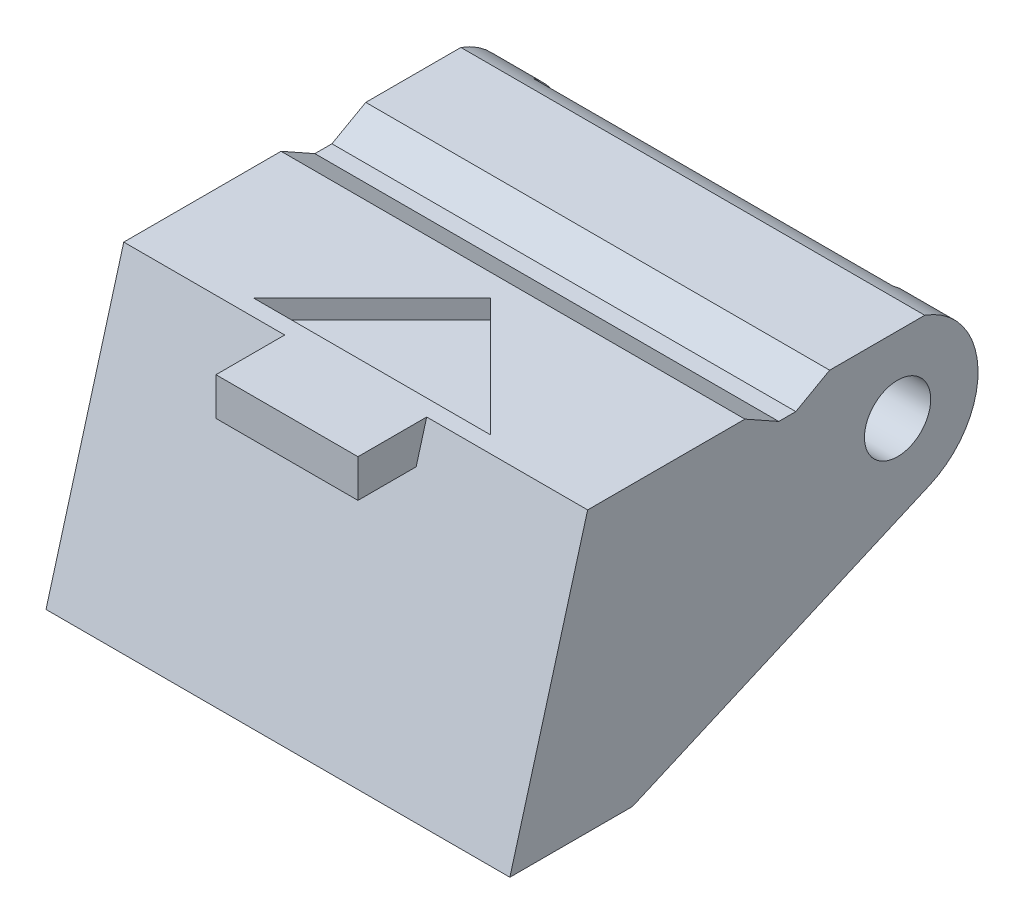
ISO-10303-21;
HEADER;
FILE_DESCRIPTION(('STEP AP214'),'2;1');
FILE_NAME('part.step','',(''),(''),'','','');
FILE_SCHEMA(('AUTOMOTIVE_DESIGN { 1 0 10303 214 1 1 1 1 }'));
ENDSEC;
DATA;
#1=APPLICATION_CONTEXT('core data for automotive mechanical design processes');
#2=APPLICATION_PROTOCOL_DEFINITION('international standard','automotive_design',2000,#1);
#3=PRODUCT_CONTEXT('',#1,'mechanical');
#4=PRODUCT('Part','Part','',(#3));
#5=PRODUCT_RELATED_PRODUCT_CATEGORY('part','',(#4));
#6=PRODUCT_DEFINITION_FORMATION('','',#4);
#7=PRODUCT_DEFINITION_CONTEXT('part definition',#1,'design');
#8=PRODUCT_DEFINITION('design','',#6,#7);
#9=PRODUCT_DEFINITION_SHAPE('','',#8);
#10=(LENGTH_UNIT() NAMED_UNIT(*) SI_UNIT(.MILLI.,.METRE.));
#11=(NAMED_UNIT(*) PLANE_ANGLE_UNIT() SI_UNIT($,.RADIAN.));
#12=(NAMED_UNIT(*) SI_UNIT($,.STERADIAN.) SOLID_ANGLE_UNIT());
#13=UNCERTAINTY_MEASURE_WITH_UNIT(LENGTH_MEASURE(1.E-05),#10,'distance_accuracy_value','');
#14=(GEOMETRIC_REPRESENTATION_CONTEXT(3) GLOBAL_UNCERTAINTY_ASSIGNED_CONTEXT((#13)) GLOBAL_UNIT_ASSIGNED_CONTEXT((#10,
#11,#12)) REPRESENTATION_CONTEXT('',''));
#15=CARTESIAN_POINT('',(0.,0.,0.));
#16=DIRECTION('',(0.,0.,1.));
#17=DIRECTION('',(1.,0.,0.));
#18=AXIS2_PLACEMENT_3D('',#15,#16,#17);
#19=CARTESIAN_POINT('',(4.9,1.6,-1.7));
#20=DIRECTION('',(0.,-1.,0.));
#21=DIRECTION('',(0.,0.,-1.));
#22=AXIS2_PLACEMENT_3D('',#19,#20,#21);
#23=PLANE('',#22);
#24=DIRECTION('',(0.,0.,1.));
#25=VECTOR('',#24,1.);
#26=CARTESIAN_POINT('',(-4.9,1.6,-1.7));
#27=LINE('',#26,#25);
#28=CARTESIAN_POINT('',(-4.9,1.6,-0.574456264653803));
#29=VERTEX_POINT('',#28);
#30=CARTESIAN_POINT('',(-4.9,1.6,1.435));
#31=VERTEX_POINT('',#30);
#32=EDGE_CURVE('E189',#29,#31,#27,.T.);
#33=ORIENTED_EDGE('',*,*,#32,.T.);
#34=DIRECTION('',(1.,0.,0.));
#35=VECTOR('',#34,1.);
#36=CARTESIAN_POINT('',(-5.,1.6,1.435));
#37=LINE('',#36,#35);
#38=CARTESIAN_POINT('',(4.9,1.6,1.435));
#39=VERTEX_POINT('',#38);
#40=EDGE_CURVE('E294',#31,#39,#37,.T.);
#41=ORIENTED_EDGE('',*,*,#40,.T.);
#42=DIRECTION('',(0.,0.,1.));
#43=VECTOR('',#42,1.);
#44=CARTESIAN_POINT('',(4.9,1.6,-1.7));
#45=LINE('',#44,#43);
#46=CARTESIAN_POINT('',(4.9,1.6,-0.574456264653803));
#47=VERTEX_POINT('',#46);
#48=EDGE_CURVE('E279',#47,#39,#45,.T.);
#49=ORIENTED_EDGE('',*,*,#48,.F.);
#50=DIRECTION('',(-1.,0.,0.));
#51=VECTOR('',#50,1.);
#52=CARTESIAN_POINT('',(4.9,1.6,-0.574456264653803));
#53=LINE('',#52,#51);
#54=EDGE_CURVE('E266',#47,#29,#53,.T.);
#55=ORIENTED_EDGE('',*,*,#54,.T.);
#56=EDGE_LOOP('',(#33,#41,#49,#55));
#57=FACE_BOUND('',#56,.T.);
#58=ADVANCED_FACE('F17',(#57),#23,.F.);
#59=CARTESIAN_POINT('',(4.9,0.,0.));
#60=DIRECTION('',(-1.,0.,0.));
#61=DIRECTION('',(0.,0.,1.));
#62=AXIS2_PLACEMENT_3D('',#59,#60,#61);
#63=CYLINDRICAL_SURFACE('',#62,1.7);
#64=CARTESIAN_POINT('',(3.8,0.,0.));
#65=DIRECTION('',(1.,0.,0.));
#66=DIRECTION('',(0.,0.,-1.));
#67=AXIS2_PLACEMENT_3D('',#64,#65,#66);
#68=CIRCLE('',#67,1.7);
#69=CARTESIAN_POINT('',(3.8,-1.55797498876303,-0.680230794943039));
#70=VERTEX_POINT('',#69);
#71=CARTESIAN_POINT('',(3.8,1.38081445189058,-0.991640786499881));
#72=VERTEX_POINT('',#71);
#73=EDGE_CURVE('E256',#70,#72,#68,.T.);
#74=ORIENTED_EDGE('',*,*,#73,.T.);
#75=DIRECTION('',(-1.,0.,0.));
#76=VECTOR('',#75,1.);
#77=CARTESIAN_POINT('',(3.8,1.38081445189058,-0.991640786499881));
#78=LINE('',#77,#76);
#79=CARTESIAN_POINT('',(-3.8,1.38081445189058,-0.991640786499881));
#80=VERTEX_POINT('',#79);
#81=EDGE_CURVE('E233',#72,#80,#78,.T.);
#82=ORIENTED_EDGE('',*,*,#81,.T.);
#83=CARTESIAN_POINT('',(-3.8,0.,0.));
#84=DIRECTION('',(1.,0.,0.));
#85=DIRECTION('',(0.,0.,-1.));
#86=AXIS2_PLACEMENT_3D('',#83,#84,#85);
#87=CIRCLE('',#86,1.7);
#88=CARTESIAN_POINT('',(-3.8,-1.55797498876303,-0.680230794943039));
#89=VERTEX_POINT('',#88);
#90=EDGE_CURVE('E339',#89,#80,#87,.T.);
#91=ORIENTED_EDGE('',*,*,#90,.F.);
#92=DIRECTION('',(1.,0.,0.));
#93=VECTOR('',#92,1.);
#94=CARTESIAN_POINT('',(-4.9,-1.55797498876303,-0.680230794943039));
#95=LINE('',#94,#93);
#96=CARTESIAN_POINT('',(-4.9,-1.55797498876303,-0.680230794943039));
#97=VERTEX_POINT('',#96);
#98=EDGE_CURVE('E190',#97,#89,#95,.T.);
#99=ORIENTED_EDGE('',*,*,#98,.F.);
#100=CARTESIAN_POINT('',(-4.9,0.,0.));
#101=DIRECTION('',(-1.,0.,0.));
#102=DIRECTION('',(0.,0.,-1.));
#103=AXIS2_PLACEMENT_3D('',#100,#101,#102);
#104=CIRCLE('',#103,1.7);
#105=EDGE_CURVE('E348',#29,#97,#104,.T.);
#106=ORIENTED_EDGE('',*,*,#105,.F.);
#107=ORIENTED_EDGE('',*,*,#54,.F.);
#108=CARTESIAN_POINT('',(4.9,0.,0.));
#109=DIRECTION('',(-1.,0.,0.));
#110=DIRECTION('',(0.,0.,-1.));
#111=AXIS2_PLACEMENT_3D('',#108,#109,#110);
#112=CIRCLE('',#111,1.7);
#113=CARTESIAN_POINT('',(4.9,-1.55797498876303,-0.680230794943039));
#114=VERTEX_POINT('',#113);
#115=EDGE_CURVE('E268',#47,#114,#112,.T.);
#116=ORIENTED_EDGE('',*,*,#115,.T.);
#117=DIRECTION('',(-1.,0.,0.));
#118=VECTOR('',#117,1.);
#119=CARTESIAN_POINT('',(4.9,-1.55797498876303,-0.680230794943039));
#120=LINE('',#119,#118);
#121=EDGE_CURVE('E276',#114,#70,#120,.T.);
#122=ORIENTED_EDGE('',*,*,#121,.T.);
#123=EDGE_LOOP('',(#74,#82,#91,#99,#106,#107,#116,#122));
#124=FACE_BOUND('',#123,.T.);
#125=ADVANCED_FACE('F388',(#124),#63,.T.);
#126=CARTESIAN_POINT('',(3.8,0.799999999999999,5.94));
#127=DIRECTION('',(0.,-1.,0.));
#128=DIRECTION('',(0.,0.,-1.));
#129=AXIS2_PLACEMENT_3D('',#126,#127,#128);
#130=PLANE('',#129);
#131=DIRECTION('',(-1.,0.,0.));
#132=VECTOR('',#131,1.);
#133=CARTESIAN_POINT('',(3.8,0.799999999999999,5.94));
#134=LINE('',#133,#132);
#135=CARTESIAN_POINT('',(3.8,0.799999999999999,5.94));
#136=VERTEX_POINT('',#135);
#137=CARTESIAN_POINT('',(-3.8,0.799999999999999,5.94));
#138=VERTEX_POINT('',#137);
#139=EDGE_CURVE('E264',#136,#138,#134,.T.);
#140=ORIENTED_EDGE('',*,*,#139,.T.);
#141=DIRECTION('',(0.,0.,1.));
#142=VECTOR('',#141,1.);
#143=CARTESIAN_POINT('',(-3.8,0.799999999999999,5.94));
#144=LINE('',#143,#142);
#145=CARTESIAN_POINT('',(-3.8,0.799999999999999,0.0143593539448927));
#146=VERTEX_POINT('',#145);
#147=EDGE_CURVE('E342',#146,#138,#144,.T.);
#148=ORIENTED_EDGE('',*,*,#147,.F.);
#149=DIRECTION('',(-1.,0.,0.));
#150=VECTOR('',#149,1.);
#151=CARTESIAN_POINT('',(3.8,0.799999999999999,0.0143593539448927));
#152=LINE('',#151,#150);
#153=CARTESIAN_POINT('',(3.8,0.799999999999999,0.0143593539448927));
#154=VERTEX_POINT('',#153);
#155=EDGE_CURVE('E231',#154,#146,#152,.T.);
#156=ORIENTED_EDGE('',*,*,#155,.F.);
#157=DIRECTION('',(0.,0.,1.));
#158=VECTOR('',#157,1.);
#159=CARTESIAN_POINT('',(3.8,0.799999999999999,5.94));
#160=LINE('',#159,#158);
#161=EDGE_CURVE('E258',#154,#136,#160,.T.);
#162=ORIENTED_EDGE('',*,*,#161,.T.);
#163=EDGE_LOOP('',(#140,#148,#156,#162));
#164=FACE_BOUND('',#163,.T.);
#165=ADVANCED_FACE('F394',(#164),#130,.T.);
#166=CARTESIAN_POINT('',(4.9,1.6,-1.7));
#167=DIRECTION('',(-1.,0.,0.));
#168=DIRECTION('',(0.,0.,1.));
#169=AXIS2_PLACEMENT_3D('',#166,#167,#168);
#170=PLANE('',#169);
#171=ORIENTED_EDGE('',*,*,#48,.T.);
#172=DIRECTION('',(0.,-0.488231650079598,0.872714074517281));
#173=VECTOR('',#172,1.);
#174=CARTESIAN_POINT('',(4.9,2.93578159335544,-0.952709598122836));
#175=LINE('',#174,#173);
#176=CARTESIAN_POINT('',(4.9,1.2,2.15));
#177=VERTEX_POINT('',#176);
#178=EDGE_CURVE('E303',#39,#177,#175,.T.);
#179=ORIENTED_EDGE('',*,*,#178,.T.);
#180=DIRECTION('',(0.,0.,1.));
#181=VECTOR('',#180,1.);
#182=CARTESIAN_POINT('',(4.9,1.2,-1.7));
#183=LINE('',#182,#181);
#184=CARTESIAN_POINT('',(4.9,1.2,2.51));
#185=VERTEX_POINT('',#184);
#186=EDGE_CURVE('E291',#177,#185,#183,.T.);
#187=ORIENTED_EDGE('',*,*,#186,.T.);
#188=DIRECTION('',(0.,0.488231650079598,0.872714074517281));
#189=VECTOR('',#188,1.);
#190=CARTESIAN_POINT('',(4.9,-0.498476665797609,-0.526027040113224));
#191=LINE('',#190,#189);
#192=CARTESIAN_POINT('',(4.9,1.6,3.225));
#193=VERTEX_POINT('',#192);
#194=EDGE_CURVE('E297',#185,#193,#191,.T.);
#195=ORIENTED_EDGE('',*,*,#194,.T.);
#196=CARTESIAN_POINT('',(4.9,1.6,6.54768574116445));
#197=VERTEX_POINT('',#196);
#198=EDGE_CURVE('E181',#193,#197,#45,.T.);
#199=ORIENTED_EDGE('',*,*,#198,.T.);
#200=DIRECTION('',(0.,0.963355359932388,-0.268228355118429));
#201=VECTOR('',#200,1.);
#202=CARTESIAN_POINT('',(4.9,0.799999999999999,6.77043083920366));
#203=LINE('',#202,#201);
#204=CARTESIAN_POINT('',(4.9,-4.3,8.19043083920366));
#205=VERTEX_POINT('',#204);
#206=EDGE_CURVE('E243',#205,#197,#203,.T.);
#207=ORIENTED_EDGE('',*,*,#206,.F.);
#208=DIRECTION('',(0.,0.,-1.));
#209=VECTOR('',#208,1.);
#210=CARTESIAN_POINT('',(4.9,-4.3,-1.7));
#211=LINE('',#210,#209);
#212=CARTESIAN_POINT('',(4.9,-4.3,5.6));
#213=VERTEX_POINT('',#212);
#214=EDGE_CURVE('E173',#205,#213,#211,.T.);
#215=ORIENTED_EDGE('',*,*,#214,.T.);
#216=DIRECTION('',(0.,-0.4001357617312,0.916455875742958));
#217=VECTOR('',#216,1.);
#218=CARTESIAN_POINT('',(4.9,-4.3,5.6));
#219=LINE('',#218,#217);
#220=EDGE_CURVE('E270',#114,#213,#219,.T.);
#221=ORIENTED_EDGE('',*,*,#220,.F.);
#222=ORIENTED_EDGE('',*,*,#115,.F.);
#223=EDGE_LOOP('',(#171,#179,#187,#195,#199,#207,#215,#221,#222));
#224=FACE_BOUND('',#223,.T.);
#225=CARTESIAN_POINT('',(4.9,0.,0.));
#226=DIRECTION('',(1.,0.,0.));
#227=DIRECTION('',(0.,0.,-1.));
#228=AXIS2_PLACEMENT_3D('',#225,#226,#227);
#229=CIRCLE('',#228,0.7);
#230=CARTESIAN_POINT('',(4.9,0.,-0.7));
#231=VERTEX_POINT('',#230);
#232=EDGE_CURVE('E235',#231,#231,#229,.T.);
#233=ORIENTED_EDGE('',*,*,#232,.F.);
#234=EDGE_LOOP('',(#233));
#235=FACE_BOUND('',#234,.T.);
#236=ADVANCED_FACE('F380',(#224,#235),#170,.F.);
#237=CARTESIAN_POINT('',(3.8,0.,0.));
#238=DIRECTION('',(1.,0.,0.));
#239=DIRECTION('',(0.,0.,-1.));
#240=AXIS2_PLACEMENT_3D('',#237,#238,#239);
#241=PLANE('',#240);
#242=DIRECTION('',(0.,0.,-1.));
#243=VECTOR('',#242,1.);
#244=CARTESIAN_POINT('',(3.8,-4.3,7.36));
#245=LINE('',#244,#243);
#246=CARTESIAN_POINT('',(3.8,-4.3,7.36));
#247=VERTEX_POINT('',#246);
#248=CARTESIAN_POINT('',(3.8,-4.3,5.6));
#249=VERTEX_POINT('',#248);
#250=EDGE_CURVE('E250',#247,#249,#245,.T.);
#251=ORIENTED_EDGE('',*,*,#250,.F.);
#252=DIRECTION('',(0.,-0.963355359932388,0.268228355118429));
#253=VECTOR('',#252,1.);
#254=CARTESIAN_POINT('',(3.8,-4.3,7.36));
#255=LINE('',#254,#253);
#256=EDGE_CURVE('E260',#136,#247,#255,.T.);
#257=ORIENTED_EDGE('',*,*,#256,.F.);
#258=ORIENTED_EDGE('',*,*,#161,.F.);
#259=DIRECTION('',(0.,-0.499999999999995,0.866025403784441));
#260=VECTOR('',#259,1.);
#261=CARTESIAN_POINT('',(3.8,0.799999999999999,0.0143593539448927));
#262=LINE('',#261,#260);
#263=EDGE_CURVE('E229',#72,#154,#262,.T.);
#264=ORIENTED_EDGE('',*,*,#263,.F.);
#265=ORIENTED_EDGE('',*,*,#73,.F.);
#266=DIRECTION('',(0.,0.4001357617312,-0.916455875742958));
#267=VECTOR('',#266,1.);
#268=CARTESIAN_POINT('',(3.8,-1.55797498876303,-0.680230794943039));
#269=LINE('',#268,#267);
#270=EDGE_CURVE('E253',#249,#70,#269,.T.);
#271=ORIENTED_EDGE('',*,*,#270,.F.);
#272=EDGE_LOOP('',(#251,#257,#258,#264,#265,#271));
#273=FACE_BOUND('',#272,.T.);
#274=CARTESIAN_POINT('',(3.8,0.,0.));
#275=DIRECTION('',(1.,0.,0.));
#276=DIRECTION('',(0.,0.,-1.));
#277=AXIS2_PLACEMENT_3D('',#274,#275,#276);
#278=CIRCLE('',#277,0.7);
#279=CARTESIAN_POINT('',(3.8,0.,-0.7));
#280=VERTEX_POINT('',#279);
#281=EDGE_CURVE('E238',#280,#280,#278,.F.);
#282=ORIENTED_EDGE('',*,*,#281,.F.);
#283=EDGE_LOOP('',(#282));
#284=FACE_BOUND('',#283,.T.);
#285=ADVANCED_FACE('F397',(#273,#284),#241,.F.);
#286=DIRECTION('',(0.707106781186548,0.,-0.707106781186548));
#287=VECTOR('',#286,1.);
#288=CARTESIAN_POINT('',(0.,1.6,3.7));
#289=LINE('',#288,#287);
#290=CARTESIAN_POINT('',(-2.5,1.6,6.2));
#291=VERTEX_POINT('',#290);
#292=CARTESIAN_POINT('',(0.,1.6,3.7));
#293=VERTEX_POINT('',#292);
#294=EDGE_CURVE('E305',#291,#293,#289,.T.);
#295=ORIENTED_EDGE('',*,*,#294,.T.);
#296=DIRECTION('',(-0.707106781186548,0.,-0.707106781186548));
#297=VECTOR('',#296,1.);
#298=CARTESIAN_POINT('',(0.,1.6,3.7));
#299=LINE('',#298,#297);
#300=CARTESIAN_POINT('',(2.5,1.6,6.2));
#301=VERTEX_POINT('',#300);
#302=EDGE_CURVE('E201',#301,#293,#299,.T.);
#303=ORIENTED_EDGE('',*,*,#302,.F.);
#304=DIRECTION('',(1.,0.,0.));
#305=VECTOR('',#304,1.);
#306=CARTESIAN_POINT('',(2.5,1.6,6.2));
#307=LINE('',#306,#305);
#308=EDGE_CURVE('E208',#291,#301,#307,.T.);
#309=ORIENTED_EDGE('',*,*,#308,.F.);
#310=EDGE_LOOP('',(#295,#303,#309));
#311=FACE_BOUND('',#310,.T.);
#312=ORIENTED_EDGE('',*,*,#198,.F.);
#313=DIRECTION('',(1.,0.,0.));
#314=VECTOR('',#313,1.);
#315=CARTESIAN_POINT('',(-5.,1.6,3.225));
#316=LINE('',#315,#314);
#317=CARTESIAN_POINT('',(-4.9,1.6,3.225));
#318=VERTEX_POINT('',#317);
#319=EDGE_CURVE('E168',#318,#193,#316,.T.);
#320=ORIENTED_EDGE('',*,*,#319,.F.);
#321=CARTESIAN_POINT('',(-4.9,1.6,6.54768574116444));
#322=VERTEX_POINT('',#321);
#323=EDGE_CURVE('E178',#318,#322,#27,.T.);
#324=ORIENTED_EDGE('',*,*,#323,.T.);
#325=DIRECTION('',(-1.,0.,0.));
#326=VECTOR('',#325,1.);
#327=CARTESIAN_POINT('',(-1.5,1.6,6.54768574116445));
#328=LINE('',#327,#326);
#329=CARTESIAN_POINT('',(-1.5,1.6,6.54768574116445));
#330=VERTEX_POINT('',#329);
#331=EDGE_CURVE('E326',#330,#322,#328,.T.);
#332=ORIENTED_EDGE('',*,*,#331,.F.);
#333=DIRECTION('',(0.,0.,1.));
#334=VECTOR('',#333,1.);
#335=CARTESIAN_POINT('',(-1.5,1.6,6.54768574116445));
#336=LINE('',#335,#334);
#337=CARTESIAN_POINT('',(-1.5,1.6,8.));
#338=VERTEX_POINT('',#337);
#339=EDGE_CURVE('E320',#330,#338,#336,.T.);
#340=ORIENTED_EDGE('',*,*,#339,.T.);
#341=DIRECTION('',(-1.,0.,0.));
#342=VECTOR('',#341,1.);
#343=CARTESIAN_POINT('',(4.9,1.6,8.));
#344=LINE('',#343,#342);
#345=CARTESIAN_POINT('',(1.5,1.6,8.));
#346=VERTEX_POINT('',#345);
#347=EDGE_CURVE('E239',#346,#338,#344,.T.);
#348=ORIENTED_EDGE('',*,*,#347,.F.);
#349=DIRECTION('',(0.,0.,1.));
#350=VECTOR('',#349,1.);
#351=CARTESIAN_POINT('',(1.5,1.6,6.54768574116445));
#352=LINE('',#351,#350);
#353=CARTESIAN_POINT('',(1.5,1.6,6.54768574116445));
#354=VERTEX_POINT('',#353);
#355=EDGE_CURVE('E40',#354,#346,#352,.T.);
#356=ORIENTED_EDGE('',*,*,#355,.F.);
#357=DIRECTION('',(1.,0.,0.));
#358=VECTOR('',#357,1.);
#359=CARTESIAN_POINT('',(1.5,1.6,6.54768574116445));
#360=LINE('',#359,#358);
#361=EDGE_CURVE('E227',#354,#197,#360,.T.);
#362=ORIENTED_EDGE('',*,*,#361,.T.);
#363=EDGE_LOOP('',(#312,#320,#324,#332,#340,#348,#356,#362));
#364=FACE_BOUND('',#363,.T.);
#365=ADVANCED_FACE('F19',(#311,#364),#23,.F.);
#366=CARTESIAN_POINT('',(4.9,0.799999999999999,6.77043083920366));
#367=DIRECTION('',(0.,-1.,0.));
#368=DIRECTION('',(0.,0.,-1.));
#369=AXIS2_PLACEMENT_3D('',#366,#367,#368);
#370=PLANE('',#369);
#371=DIRECTION('',(0.,0.,-1.));
#372=VECTOR('',#371,1.);
#373=CARTESIAN_POINT('',(1.5,0.799999999999999,6.77043083920366));
#374=LINE('',#373,#372);
#375=CARTESIAN_POINT('',(1.5,0.799999999999999,8.));
#376=VERTEX_POINT('',#375);
#377=CARTESIAN_POINT('',(1.5,0.799999999999999,6.77043083920366));
#378=VERTEX_POINT('',#377);
#379=EDGE_CURVE('E219',#376,#378,#374,.T.);
#380=ORIENTED_EDGE('',*,*,#379,.F.);
#381=DIRECTION('',(-1.,0.,0.));
#382=VECTOR('',#381,1.);
#383=CARTESIAN_POINT('',(4.9,0.799999999999999,8.));
#384=LINE('',#383,#382);
#385=CARTESIAN_POINT('',(-1.5,0.799999999999999,8.));
#386=VERTEX_POINT('',#385);
#387=EDGE_CURVE('E241',#376,#386,#384,.T.);
#388=ORIENTED_EDGE('',*,*,#387,.T.);
#389=DIRECTION('',(0.,0.,-1.));
#390=VECTOR('',#389,1.);
#391=CARTESIAN_POINT('',(-1.5,0.799999999999999,6.77043083920366));
#392=LINE('',#391,#390);
#393=CARTESIAN_POINT('',(-1.5,0.799999999999999,6.77043083920366));
#394=VERTEX_POINT('',#393);
#395=EDGE_CURVE('E313',#386,#394,#392,.T.);
#396=ORIENTED_EDGE('',*,*,#395,.T.);
#397=DIRECTION('',(-1.,0.,0.));
#398=VECTOR('',#397,1.);
#399=CARTESIAN_POINT('',(4.9,0.799999999999999,6.77043083920366));
#400=LINE('',#399,#398);
#401=EDGE_CURVE('E246',#378,#394,#400,.T.);
#402=ORIENTED_EDGE('',*,*,#401,.F.);
#403=EDGE_LOOP('',(#380,#388,#396,#402));
#404=FACE_BOUND('',#403,.T.);
#405=ADVANCED_FACE('F421',(#404),#370,.T.);
#406=CARTESIAN_POINT('',(4.9,-4.3,-1.7));
#407=DIRECTION('',(0.,1.,0.));
#408=DIRECTION('',(0.,0.,1.));
#409=AXIS2_PLACEMENT_3D('',#406,#407,#408);
#410=PLANE('',#409);
#411=DIRECTION('',(-1.,0.,0.));
#412=VECTOR('',#411,1.);
#413=CARTESIAN_POINT('',(4.9,-4.3,8.19043083920366));
#414=LINE('',#413,#412);
#415=CARTESIAN_POINT('',(-4.9,-4.3,8.19043083920366));
#416=VERTEX_POINT('',#415);
#417=EDGE_CURVE('E248',#205,#416,#414,.T.);
#418=ORIENTED_EDGE('',*,*,#417,.T.);
#419=DIRECTION('',(0.,0.,-1.));
#420=VECTOR('',#419,1.);
#421=CARTESIAN_POINT('',(-4.9,-4.3,-1.7));
#422=LINE('',#421,#420);
#423=CARTESIAN_POINT('',(-4.9,-4.3,5.6));
#424=VERTEX_POINT('',#423);
#425=EDGE_CURVE('E193',#416,#424,#422,.T.);
#426=ORIENTED_EDGE('',*,*,#425,.T.);
#427=DIRECTION('',(1.,0.,0.));
#428=VECTOR('',#427,1.);
#429=CARTESIAN_POINT('',(-4.9,-4.3,5.6));
#430=LINE('',#429,#428);
#431=CARTESIAN_POINT('',(-3.8,-4.3,5.6));
#432=VERTEX_POINT('',#431);
#433=EDGE_CURVE('E195',#424,#432,#430,.T.);
#434=ORIENTED_EDGE('',*,*,#433,.T.);
#435=DIRECTION('',(0.,0.,-1.));
#436=VECTOR('',#435,1.);
#437=CARTESIAN_POINT('',(-3.8,-4.3,7.36));
#438=LINE('',#437,#436);
#439=CARTESIAN_POINT('',(-3.8,-4.3,7.36));
#440=VERTEX_POINT('',#439);
#441=EDGE_CURVE('E334',#440,#432,#438,.T.);
#442=ORIENTED_EDGE('',*,*,#441,.F.);
#443=DIRECTION('',(-1.,0.,0.));
#444=VECTOR('',#443,1.);
#445=CARTESIAN_POINT('',(3.8,-4.3,7.36));
#446=LINE('',#445,#444);
#447=EDGE_CURVE('E262',#247,#440,#446,.T.);
#448=ORIENTED_EDGE('',*,*,#447,.F.);
#449=ORIENTED_EDGE('',*,*,#250,.T.);
#450=DIRECTION('',(-1.,0.,0.));
#451=VECTOR('',#450,1.);
#452=CARTESIAN_POINT('',(4.9,-4.3,5.6));
#453=LINE('',#452,#451);
#454=EDGE_CURVE('E273',#213,#249,#453,.T.);
#455=ORIENTED_EDGE('',*,*,#454,.F.);
#456=ORIENTED_EDGE('',*,*,#214,.F.);
#457=EDGE_LOOP('',(#418,#426,#434,#442,#448,#449,#455,#456));
#458=FACE_BOUND('',#457,.T.);
#459=ADVANCED_FACE('F356',(#458),#410,.F.);
#460=CARTESIAN_POINT('',(4.9,-4.3,5.6));
#461=DIRECTION('',(0.,-0.916455875742958,-0.4001357617312));
#462=DIRECTION('',(0.,0.4001357617312,-0.916455875742958));
#463=AXIS2_PLACEMENT_3D('',#460,#461,#462);
#464=PLANE('',#463);
#465=ORIENTED_EDGE('',*,*,#270,.T.);
#466=ORIENTED_EDGE('',*,*,#121,.F.);
#467=ORIENTED_EDGE('',*,*,#220,.T.);
#468=ORIENTED_EDGE('',*,*,#454,.T.);
#469=EDGE_LOOP('',(#465,#466,#467,#468));
#470=FACE_BOUND('',#469,.T.);
#471=ADVANCED_FACE('F376',(#470),#464,.T.);
#472=CARTESIAN_POINT('',(3.8,-4.3,7.36));
#473=DIRECTION('',(0.,-0.268228355118429,-0.963355359932388));
#474=DIRECTION('',(0.,0.963355359932389,-0.268228355118429));
#475=AXIS2_PLACEMENT_3D('',#472,#473,#474);
#476=PLANE('',#475);
#477=ORIENTED_EDGE('',*,*,#447,.T.);
#478=DIRECTION('',(0.,-0.963355359932388,0.268228355118429));
#479=VECTOR('',#478,1.);
#480=CARTESIAN_POINT('',(-3.8,-4.3,7.36));
#481=LINE('',#480,#479);
#482=EDGE_CURVE('E345',#138,#440,#481,.T.);
#483=ORIENTED_EDGE('',*,*,#482,.F.);
#484=ORIENTED_EDGE('',*,*,#139,.F.);
#485=ORIENTED_EDGE('',*,*,#256,.T.);
#486=EDGE_LOOP('',(#477,#483,#484,#485));
#487=FACE_BOUND('',#486,.T.);
#488=ADVANCED_FACE('F369',(#487),#476,.T.);
#489=CARTESIAN_POINT('',(4.9,0.799999999999999,6.77043083920366));
#490=DIRECTION('',(0.,0.268228355118429,0.963355359932388));
#491=DIRECTION('',(0.,-0.963355359932389,0.268228355118429));
#492=AXIS2_PLACEMENT_3D('',#489,#490,#491);
#493=PLANE('',#492);
#494=ORIENTED_EDGE('',*,*,#401,.T.);
#495=DIRECTION('',(0.,0.963355359932388,-0.268228355118431));
#496=VECTOR('',#495,1.);
#497=CARTESIAN_POINT('',(-1.5,1.6,6.54768574116445));
#498=LINE('',#497,#496);
#499=EDGE_CURVE('E318',#394,#330,#498,.T.);
#500=ORIENTED_EDGE('',*,*,#499,.T.);
#501=ORIENTED_EDGE('',*,*,#331,.T.);
#502=DIRECTION('',(0.,0.963355359932388,-0.268228355118429));
#503=VECTOR('',#502,1.);
#504=CARTESIAN_POINT('',(-4.9,0.799999999999999,6.77043083920366));
#505=LINE('',#504,#503);
#506=EDGE_CURVE('E188',#416,#322,#505,.T.);
#507=ORIENTED_EDGE('',*,*,#506,.F.);
#508=ORIENTED_EDGE('',*,*,#417,.F.);
#509=ORIENTED_EDGE('',*,*,#206,.T.);
#510=ORIENTED_EDGE('',*,*,#361,.F.);
#511=DIRECTION('',(0.,0.963355359932388,-0.268228355118431));
#512=VECTOR('',#511,1.);
#513=CARTESIAN_POINT('',(1.5,1.6,6.54768574116445));
#514=LINE('',#513,#512);
#515=EDGE_CURVE('E222',#378,#354,#514,.T.);
#516=ORIENTED_EDGE('',*,*,#515,.F.);
#517=EDGE_LOOP('',(#494,#500,#501,#507,#508,#509,#510,#516));
#518=FACE_BOUND('',#517,.T.);
#519=ADVANCED_FACE('F385',(#518),#493,.T.);
#520=CARTESIAN_POINT('',(4.9,1.6,8.));
#521=DIRECTION('',(0.,0.,1.));
#522=DIRECTION('',(1.,0.,0.));
#523=AXIS2_PLACEMENT_3D('',#520,#521,#522);
#524=PLANE('',#523);
#525=DIRECTION('',(0.,-1.,0.));
#526=VECTOR('',#525,1.);
#527=CARTESIAN_POINT('',(1.5,0.799999999999999,8.));
#528=LINE('',#527,#526);
#529=EDGE_CURVE('E225',#346,#376,#528,.T.);
#530=ORIENTED_EDGE('',*,*,#529,.F.);
#531=ORIENTED_EDGE('',*,*,#347,.T.);
#532=DIRECTION('',(0.,-1.,0.));
#533=VECTOR('',#532,1.);
#534=CARTESIAN_POINT('',(-1.5,0.799999999999999,8.));
#535=LINE('',#534,#533);
#536=EDGE_CURVE('E323',#338,#386,#535,.T.);
#537=ORIENTED_EDGE('',*,*,#536,.T.);
#538=ORIENTED_EDGE('',*,*,#387,.F.);
#539=EDGE_LOOP('',(#530,#531,#537,#538));
#540=FACE_BOUND('',#539,.T.);
#541=ADVANCED_FACE('F411',(#540),#524,.T.);
#542=CARTESIAN_POINT('',(4.9,0.,0.));
#543=DIRECTION('',(-1.,0.,0.));
#544=DIRECTION('',(0.,0.,1.));
#545=AXIS2_PLACEMENT_3D('',#542,#543,#544);
#546=CYLINDRICAL_SURFACE('',#545,0.7);
#547=ORIENTED_EDGE('',*,*,#232,.T.);
#548=EDGE_LOOP('',(#547));
#549=FACE_BOUND('',#548,.T.);
#550=ORIENTED_EDGE('',*,*,#281,.T.);
#551=EDGE_LOOP('',(#550));
#552=FACE_BOUND('',#551,.T.);
#553=ADVANCED_FACE('F402',(#549,#552),#546,.F.);
#554=CARTESIAN_POINT('',(3.8,0.799999999999999,0.0143593539448927));
#555=DIRECTION('',(0.,-0.866025403784441,-0.499999999999995));
#556=DIRECTION('',(0.,0.499999999999995,-0.866025403784441));
#557=AXIS2_PLACEMENT_3D('',#554,#555,#556);
#558=PLANE('',#557);
#559=ORIENTED_EDGE('',*,*,#155,.T.);
#560=DIRECTION('',(0.,-0.499999999999995,0.866025403784441));
#561=VECTOR('',#560,1.);
#562=CARTESIAN_POINT('',(-3.8,0.799999999999999,0.0143593539448927));
#563=LINE('',#562,#561);
#564=EDGE_CURVE('E328',#80,#146,#563,.T.);
#565=ORIENTED_EDGE('',*,*,#564,.F.);
#566=ORIENTED_EDGE('',*,*,#81,.F.);
#567=ORIENTED_EDGE('',*,*,#263,.T.);
#568=EDGE_LOOP('',(#559,#565,#566,#567));
#569=FACE_BOUND('',#568,.T.);
#570=ADVANCED_FACE('F399',(#569),#558,.T.);
#571=CARTESIAN_POINT('',(1.5,0.799999999999999,8.));
#572=DIRECTION('',(-1.,0.,0.));
#573=DIRECTION('',(0.,0.,1.));
#574=AXIS2_PLACEMENT_3D('',#571,#572,#573);
#575=PLANE('',#574);
#576=ORIENTED_EDGE('',*,*,#379,.T.);
#577=ORIENTED_EDGE('',*,*,#515,.T.);
#578=ORIENTED_EDGE('',*,*,#355,.T.);
#579=ORIENTED_EDGE('',*,*,#529,.T.);
#580=EDGE_LOOP('',(#576,#577,#578,#579));
#581=FACE_BOUND('',#580,.T.);
#582=ADVANCED_FACE('F401',(#581),#575,.F.);
#583=CARTESIAN_POINT('',(0.,1.2,3.7));
#584=DIRECTION('',(0.707106781186548,0.,-0.707106781186548));
#585=DIRECTION('',(-0.707106781186548,0.,-0.707106781186548));
#586=AXIS2_PLACEMENT_3D('',#583,#584,#585);
#587=PLANE('',#586);
#588=ORIENTED_EDGE('',*,*,#302,.T.);
#589=DIRECTION('',(0.,1.,0.));
#590=VECTOR('',#589,1.);
#591=CARTESIAN_POINT('',(0.,1.2,3.7));
#592=LINE('',#591,#590);
#593=CARTESIAN_POINT('',(0.,1.2,3.7));
#594=VERTEX_POINT('',#593);
#595=EDGE_CURVE('E309',#594,#293,#592,.T.);
#596=ORIENTED_EDGE('',*,*,#595,.F.);
#597=DIRECTION('',(-0.707106781186548,0.,-0.707106781186548));
#598=VECTOR('',#597,1.);
#599=CARTESIAN_POINT('',(0.,1.2,3.7));
#600=LINE('',#599,#598);
#601=CARTESIAN_POINT('',(2.5,1.2,6.2));
#602=VERTEX_POINT('',#601);
#603=EDGE_CURVE('E211',#602,#594,#600,.T.);
#604=ORIENTED_EDGE('',*,*,#603,.F.);
#605=DIRECTION('',(0.,1.,0.));
#606=VECTOR('',#605,1.);
#607=CARTESIAN_POINT('',(2.5,1.2,6.2));
#608=LINE('',#607,#606);
#609=EDGE_CURVE('E217',#602,#301,#608,.T.);
#610=ORIENTED_EDGE('',*,*,#609,.T.);
#611=EDGE_LOOP('',(#588,#596,#604,#610));
#612=FACE_BOUND('',#611,.T.);
#613=ADVANCED_FACE('F409',(#612),#587,.F.);
#614=CARTESIAN_POINT('',(2.5,1.2,6.2));
#615=DIRECTION('',(0.,0.,1.));
#616=DIRECTION('',(0.,-1.,0.));
#617=AXIS2_PLACEMENT_3D('',#614,#615,#616);
#618=PLANE('',#617);
#619=ORIENTED_EDGE('',*,*,#308,.T.);
#620=ORIENTED_EDGE('',*,*,#609,.F.);
#621=DIRECTION('',(1.,0.,0.));
#622=VECTOR('',#621,1.);
#623=CARTESIAN_POINT('',(2.5,1.2,6.2));
#624=LINE('',#623,#622);
#625=CARTESIAN_POINT('',(-2.5,1.2,6.2));
#626=VERTEX_POINT('',#625);
#627=EDGE_CURVE('E214',#626,#602,#624,.T.);
#628=ORIENTED_EDGE('',*,*,#627,.F.);
#629=DIRECTION('',(0.,1.,0.));
#630=VECTOR('',#629,1.);
#631=CARTESIAN_POINT('',(-2.5,1.2,6.2));
#632=LINE('',#631,#630);
#633=EDGE_CURVE('E310',#626,#291,#632,.T.);
#634=ORIENTED_EDGE('',*,*,#633,.T.);
#635=EDGE_LOOP('',(#619,#620,#628,#634));
#636=FACE_BOUND('',#635,.T.);
#637=ADVANCED_FACE('F440',(#636),#618,.F.);
#638=CARTESIAN_POINT('',(2.5,1.2,6.2));
#639=DIRECTION('',(0.,-1.,0.));
#640=DIRECTION('',(0.,0.,-1.));
#641=AXIS2_PLACEMENT_3D('',#638,#639,#640);
#642=PLANE('',#641);
#643=ORIENTED_EDGE('',*,*,#603,.T.);
#644=DIRECTION('',(0.707106781186548,0.,-0.707106781186548));
#645=VECTOR('',#644,1.);
#646=CARTESIAN_POINT('',(0.,1.2,3.7));
#647=LINE('',#646,#645);
#648=EDGE_CURVE('E307',#626,#594,#647,.T.);
#649=ORIENTED_EDGE('',*,*,#648,.F.);
#650=ORIENTED_EDGE('',*,*,#627,.T.);
#651=EDGE_LOOP('',(#643,#649,#650));
#652=FACE_BOUND('',#651,.T.);
#653=ADVANCED_FACE('F442',(#652),#642,.F.);
#654=CARTESIAN_POINT('',(-4.9,1.6,-1.7));
#655=DIRECTION('',(1.,0.,0.));
#656=DIRECTION('',(0.,0.,1.));
#657=AXIS2_PLACEMENT_3D('',#654,#655,#656);
#658=PLANE('',#657);
#659=DIRECTION('',(0.,0.,-1.));
#660=VECTOR('',#659,1.);
#661=CARTESIAN_POINT('',(-4.9,1.2,-1.7));
#662=LINE('',#661,#660);
#663=CARTESIAN_POINT('',(-4.9,1.2,2.51));
#664=VERTEX_POINT('',#663);
#665=CARTESIAN_POINT('',(-4.9,1.2,2.15));
#666=VERTEX_POINT('',#665);
#667=EDGE_CURVE('E25',#664,#666,#662,.T.);
#668=ORIENTED_EDGE('',*,*,#667,.T.);
#669=DIRECTION('',(0.,0.488231650079598,-0.872714074517281));
#670=VECTOR('',#669,1.);
#671=CARTESIAN_POINT('',(-4.9,2.93578159335544,-0.952709598122836));
#672=LINE('',#671,#670);
#673=EDGE_CURVE('E11',#666,#31,#672,.T.);
#674=ORIENTED_EDGE('',*,*,#673,.T.);
#675=ORIENTED_EDGE('',*,*,#32,.F.);
#676=ORIENTED_EDGE('',*,*,#105,.T.);
#677=DIRECTION('',(0.,-0.4001357617312,0.916455875742958));
#678=VECTOR('',#677,1.);
#679=CARTESIAN_POINT('',(-4.9,-4.3,5.6));
#680=LINE('',#679,#678);
#681=EDGE_CURVE('E351',#97,#424,#680,.T.);
#682=ORIENTED_EDGE('',*,*,#681,.T.);
#683=ORIENTED_EDGE('',*,*,#425,.F.);
#684=ORIENTED_EDGE('',*,*,#506,.T.);
#685=ORIENTED_EDGE('',*,*,#323,.F.);
#686=DIRECTION('',(0.,-0.488231650079598,-0.872714074517281));
#687=VECTOR('',#686,1.);
#688=CARTESIAN_POINT('',(-4.9,-0.498476665797609,-0.526027040113227));
#689=LINE('',#688,#687);
#690=EDGE_CURVE('E165',#318,#664,#689,.T.);
#691=ORIENTED_EDGE('',*,*,#690,.T.);
#692=EDGE_LOOP('',(#668,#674,#675,#676,#682,#683,#684,#685,#691));
#693=FACE_BOUND('',#692,.T.);
#694=CARTESIAN_POINT('',(-4.9,0.,0.));
#695=DIRECTION('',(1.,0.,0.));
#696=DIRECTION('',(0.,0.,-1.));
#697=AXIS2_PLACEMENT_3D('',#694,#695,#696);
#698=CIRCLE('',#697,0.7);
#699=CARTESIAN_POINT('',(-4.9,0.,-0.7));
#700=VERTEX_POINT('',#699);
#701=EDGE_CURVE('E205',#700,#700,#698,.T.);
#702=ORIENTED_EDGE('',*,*,#701,.T.);
#703=EDGE_LOOP('',(#702));
#704=FACE_BOUND('',#703,.T.);
#705=ADVANCED_FACE('F184',(#693,#704),#658,.F.);
#706=CARTESIAN_POINT('',(-3.8,0.,0.));
#707=DIRECTION('',(-1.,0.,0.));
#708=DIRECTION('',(0.,0.,-1.));
#709=AXIS2_PLACEMENT_3D('',#706,#707,#708);
#710=PLANE('',#709);
#711=ORIENTED_EDGE('',*,*,#441,.T.);
#712=DIRECTION('',(0.,0.4001357617312,-0.916455875742958));
#713=VECTOR('',#712,1.);
#714=CARTESIAN_POINT('',(-3.8,-1.55797498876303,-0.680230794943039));
#715=LINE('',#714,#713);
#716=EDGE_CURVE('E337',#432,#89,#715,.T.);
#717=ORIENTED_EDGE('',*,*,#716,.T.);
#718=ORIENTED_EDGE('',*,*,#90,.T.);
#719=ORIENTED_EDGE('',*,*,#564,.T.);
#720=ORIENTED_EDGE('',*,*,#147,.T.);
#721=ORIENTED_EDGE('',*,*,#482,.T.);
#722=EDGE_LOOP('',(#711,#717,#718,#719,#720,#721));
#723=FACE_BOUND('',#722,.T.);
#724=CARTESIAN_POINT('',(-3.8,0.,0.));
#725=DIRECTION('',(1.,0.,0.));
#726=DIRECTION('',(0.,0.,-1.));
#727=AXIS2_PLACEMENT_3D('',#724,#725,#726);
#728=CIRCLE('',#727,0.7);
#729=CARTESIAN_POINT('',(-3.8,0.,-0.7));
#730=VERTEX_POINT('',#729);
#731=EDGE_CURVE('E202',#730,#730,#728,.F.);
#732=ORIENTED_EDGE('',*,*,#731,.T.);
#733=EDGE_LOOP('',(#732));
#734=FACE_BOUND('',#733,.T.);
#735=ADVANCED_FACE('F363',(#723,#734),#710,.F.);
#736=CARTESIAN_POINT('',(-4.9,-4.3,5.6));
#737=DIRECTION('',(0.,-0.916455875742958,-0.4001357617312));
#738=DIRECTION('',(0.,0.4001357617312,-0.916455875742958));
#739=AXIS2_PLACEMENT_3D('',#736,#737,#738);
#740=PLANE('',#739);
#741=ORIENTED_EDGE('',*,*,#716,.F.);
#742=ORIENTED_EDGE('',*,*,#433,.F.);
#743=ORIENTED_EDGE('',*,*,#681,.F.);
#744=ORIENTED_EDGE('',*,*,#98,.T.);
#745=EDGE_LOOP('',(#741,#742,#743,#744));
#746=FACE_BOUND('',#745,.T.);
#747=ADVANCED_FACE('F359',(#746),#740,.T.);
#748=CARTESIAN_POINT('',(-4.9,0.,0.));
#749=DIRECTION('',(1.,0.,0.));
#750=DIRECTION('',(0.,0.,1.));
#751=AXIS2_PLACEMENT_3D('',#748,#749,#750);
#752=CYLINDRICAL_SURFACE('',#751,0.7);
#753=ORIENTED_EDGE('',*,*,#701,.F.);
#754=EDGE_LOOP('',(#753));
#755=FACE_BOUND('',#754,.T.);
#756=ORIENTED_EDGE('',*,*,#731,.F.);
#757=EDGE_LOOP('',(#756));
#758=FACE_BOUND('',#757,.T.);
#759=ADVANCED_FACE('F497',(#755,#758),#752,.F.);
#760=CARTESIAN_POINT('',(-1.5,0.799999999999999,8.));
#761=DIRECTION('',(1.,0.,0.));
#762=DIRECTION('',(0.,0.,1.));
#763=AXIS2_PLACEMENT_3D('',#760,#761,#762);
#764=PLANE('',#763);
#765=ORIENTED_EDGE('',*,*,#395,.F.);
#766=ORIENTED_EDGE('',*,*,#536,.F.);
#767=ORIENTED_EDGE('',*,*,#339,.F.);
#768=ORIENTED_EDGE('',*,*,#499,.F.);
#769=EDGE_LOOP('',(#765,#766,#767,#768));
#770=FACE_BOUND('',#769,.T.);
#771=ADVANCED_FACE('F505',(#770),#764,.F.);
#772=CARTESIAN_POINT('',(0.,1.2,3.7));
#773=DIRECTION('',(-0.707106781186548,0.,-0.707106781186548));
#774=DIRECTION('',(0.707106781186548,0.,-0.707106781186548));
#775=AXIS2_PLACEMENT_3D('',#772,#773,#774);
#776=PLANE('',#775);
#777=ORIENTED_EDGE('',*,*,#294,.F.);
#778=ORIENTED_EDGE('',*,*,#633,.F.);
#779=ORIENTED_EDGE('',*,*,#648,.T.);
#780=ORIENTED_EDGE('',*,*,#595,.T.);
#781=EDGE_LOOP('',(#777,#778,#779,#780));
#782=FACE_BOUND('',#781,.T.);
#783=ADVANCED_FACE('F435',(#782),#776,.F.);
#784=CARTESIAN_POINT('',(-5.,1.2,2.15));
#785=DIRECTION('',(0.,-0.872714074517281,-0.488231650079598));
#786=DIRECTION('',(0.,0.488231650079598,-0.872714074517281));
#787=AXIS2_PLACEMENT_3D('',#784,#785,#786);
#788=PLANE('',#787);
#789=ORIENTED_EDGE('',*,*,#40,.F.);
#790=ORIENTED_EDGE('',*,*,#673,.F.);
#791=DIRECTION('',(1.,0.,0.));
#792=VECTOR('',#791,1.);
#793=CARTESIAN_POINT('',(-5.,1.2,2.15));
#794=LINE('',#793,#792);
#795=EDGE_CURVE('E290',#666,#177,#794,.T.);
#796=ORIENTED_EDGE('',*,*,#795,.T.);
#797=ORIENTED_EDGE('',*,*,#178,.F.);
#798=EDGE_LOOP('',(#789,#790,#796,#797));
#799=FACE_BOUND('',#798,.T.);
#800=ADVANCED_FACE('F524',(#799),#788,.F.);
#801=CARTESIAN_POINT('',(-5.,1.2,2.51));
#802=DIRECTION('',(0.,-1.,0.));
#803=DIRECTION('',(0.,0.,-1.));
#804=AXIS2_PLACEMENT_3D('',#801,#802,#803);
#805=PLANE('',#804);
#806=ORIENTED_EDGE('',*,*,#795,.F.);
#807=ORIENTED_EDGE('',*,*,#667,.F.);
#808=DIRECTION('',(1.,0.,0.));
#809=VECTOR('',#808,1.);
#810=CARTESIAN_POINT('',(-5.,1.2,2.51));
#811=LINE('',#810,#809);
#812=EDGE_CURVE('E32',#664,#185,#811,.T.);
#813=ORIENTED_EDGE('',*,*,#812,.T.);
#814=ORIENTED_EDGE('',*,*,#186,.F.);
#815=EDGE_LOOP('',(#806,#807,#813,#814));
#816=FACE_BOUND('',#815,.T.);
#817=ADVANCED_FACE('F287',(#816),#805,.F.);
#818=CARTESIAN_POINT('',(-5.,1.6,3.225));
#819=DIRECTION('',(0.,-0.872714074517281,0.488231650079598));
#820=DIRECTION('',(0.,-0.488231650079598,-0.872714074517281));
#821=AXIS2_PLACEMENT_3D('',#818,#819,#820);
#822=PLANE('',#821);
#823=ORIENTED_EDGE('',*,*,#812,.F.);
#824=ORIENTED_EDGE('',*,*,#690,.F.);
#825=ORIENTED_EDGE('',*,*,#319,.T.);
#826=ORIENTED_EDGE('',*,*,#194,.F.);
#827=EDGE_LOOP('',(#823,#824,#825,#826));
#828=FACE_BOUND('',#827,.T.);
#829=ADVANCED_FACE('F167',(#828),#822,.F.);
#830=CLOSED_SHELL('',(#58,#125,#165,#236,#285,#365,#405,#459,#471,#488,#519,#541,#553,#570,#582,
#613,#637,#653,#705,#735,#747,#759,#771,#783,#800,#817,#829));
#831=MANIFOLD_SOLID_BREP('B1',#830);
#832=ADVANCED_BREP_SHAPE_REPRESENTATION('',(#18,#831),#14);
#833=SHAPE_DEFINITION_REPRESENTATION(#9,#832);
ENDSEC;
END-ISO-10303-21;
